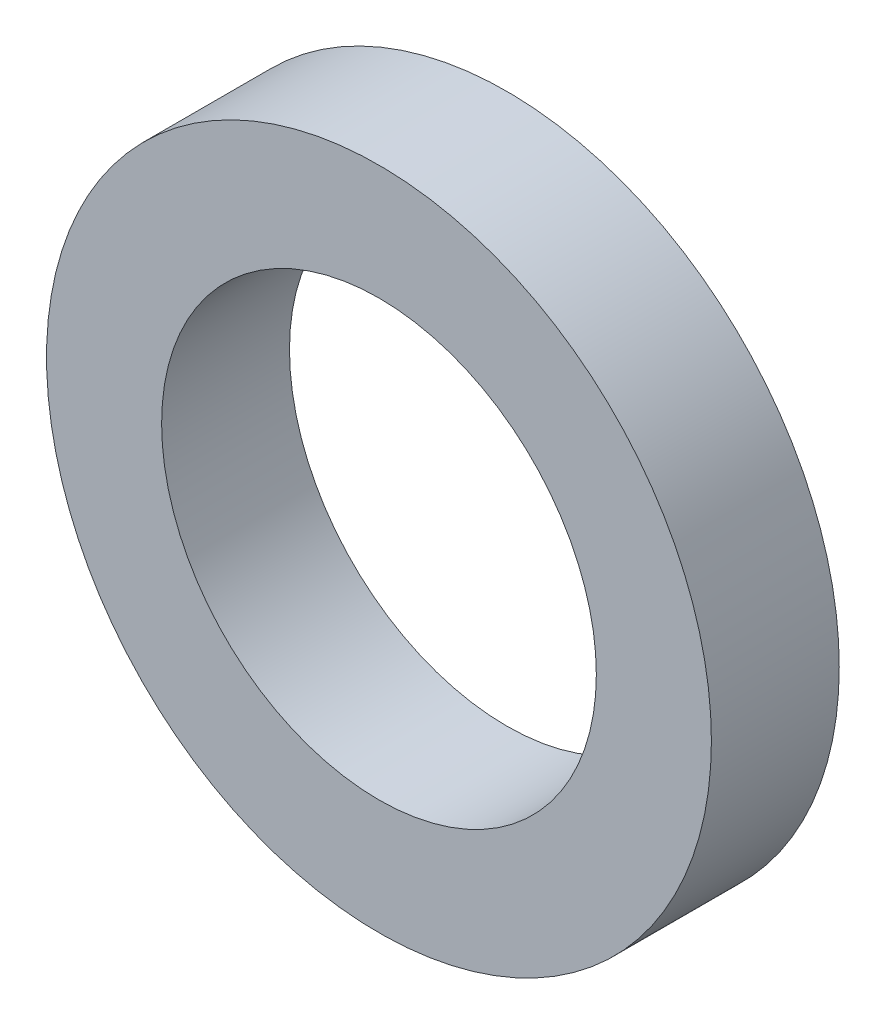
ISO-10303-21;
HEADER;
FILE_DESCRIPTION(('STEP AP214'),'2;1');
FILE_NAME('part.step','',(''),(''),'','','');
FILE_SCHEMA(('AUTOMOTIVE_DESIGN { 1 0 10303 214 1 1 1 1 }'));
ENDSEC;
DATA;
#1=APPLICATION_CONTEXT('core data for automotive mechanical design processes');
#2=APPLICATION_PROTOCOL_DEFINITION('international standard','automotive_design',2000,#1);
#3=PRODUCT_CONTEXT('',#1,'mechanical');
#4=PRODUCT('Part','Part','',(#3));
#5=PRODUCT_RELATED_PRODUCT_CATEGORY('part','',(#4));
#6=PRODUCT_DEFINITION_FORMATION('','',#4);
#7=PRODUCT_DEFINITION_CONTEXT('part definition',#1,'design');
#8=PRODUCT_DEFINITION('design','',#6,#7);
#9=PRODUCT_DEFINITION_SHAPE('','',#8);
#10=(LENGTH_UNIT() NAMED_UNIT(*) SI_UNIT(.MILLI.,.METRE.));
#11=(NAMED_UNIT(*) PLANE_ANGLE_UNIT() SI_UNIT($,.RADIAN.));
#12=(NAMED_UNIT(*) SI_UNIT($,.STERADIAN.) SOLID_ANGLE_UNIT());
#13=UNCERTAINTY_MEASURE_WITH_UNIT(LENGTH_MEASURE(1.E-05),#10,'distance_accuracy_value','');
#14=(GEOMETRIC_REPRESENTATION_CONTEXT(3) GLOBAL_UNCERTAINTY_ASSIGNED_CONTEXT((#13)) GLOBAL_UNIT_ASSIGNED_CONTEXT((#10,
#11,#12)) REPRESENTATION_CONTEXT('',''));
#15=CARTESIAN_POINT('',(0.,0.,0.));
#16=DIRECTION('',(0.,0.,1.));
#17=DIRECTION('',(1.,0.,0.));
#18=AXIS2_PLACEMENT_3D('',#15,#16,#17);
#19=CARTESIAN_POINT('',(0.,0.,5.));
#20=DIRECTION('',(0.,0.,1.));
#21=DIRECTION('',(1.,0.,0.));
#22=AXIS2_PLACEMENT_3D('',#19,#20,#21);
#23=PLANE('',#22);
#24=CARTESIAN_POINT('',(0.,0.,5.));
#25=DIRECTION('',(0.,0.,1.));
#26=DIRECTION('',(1.,0.,0.));
#27=AXIS2_PLACEMENT_3D('',#24,#25,#26);
#28=CIRCLE('',#27,13.);
#29=CARTESIAN_POINT('',(13.,0.,5.));
#30=VERTEX_POINT('',#29);
#31=EDGE_CURVE('E10',#30,#30,#28,.T.);
#32=ORIENTED_EDGE('',*,*,#31,.T.);
#33=EDGE_LOOP('',(#32));
#34=FACE_BOUND('',#33,.T.);
#35=CARTESIAN_POINT('',(0.,0.,5.));
#36=DIRECTION('',(0.,0.,1.));
#37=DIRECTION('',(1.,0.,0.));
#38=AXIS2_PLACEMENT_3D('',#35,#36,#37);
#39=CIRCLE('',#38,8.5);
#40=CARTESIAN_POINT('',(8.5,0.,5.));
#41=VERTEX_POINT('',#40);
#42=EDGE_CURVE('E48',#41,#41,#39,.T.);
#43=ORIENTED_EDGE('',*,*,#42,.F.);
#44=EDGE_LOOP('',(#43));
#45=FACE_BOUND('',#44,.T.);
#46=ADVANCED_FACE('F37',(#34,#45),#23,.T.);
#47=CARTESIAN_POINT('',(0.,0.,0.));
#48=DIRECTION('',(0.,0.,1.));
#49=DIRECTION('',(1.,0.,0.));
#50=AXIS2_PLACEMENT_3D('',#47,#48,#49);
#51=PLANE('',#50);
#52=CARTESIAN_POINT('',(0.,0.,0.));
#53=DIRECTION('',(0.,0.,1.));
#54=DIRECTION('',(1.,0.,0.));
#55=AXIS2_PLACEMENT_3D('',#52,#53,#54);
#56=CIRCLE('',#55,13.);
#57=CARTESIAN_POINT('',(13.,0.,0.));
#58=VERTEX_POINT('',#57);
#59=EDGE_CURVE('E41',#58,#58,#56,.T.);
#60=ORIENTED_EDGE('',*,*,#59,.F.);
#61=EDGE_LOOP('',(#60));
#62=FACE_BOUND('',#61,.T.);
#63=CARTESIAN_POINT('',(0.,0.,0.));
#64=DIRECTION('',(0.,0.,1.));
#65=DIRECTION('',(1.,0.,0.));
#66=AXIS2_PLACEMENT_3D('',#63,#64,#65);
#67=CIRCLE('',#66,8.5);
#68=CARTESIAN_POINT('',(8.5,0.,0.));
#69=VERTEX_POINT('',#68);
#70=EDGE_CURVE('E50',#69,#69,#67,.T.);
#71=ORIENTED_EDGE('',*,*,#70,.T.);
#72=EDGE_LOOP('',(#71));
#73=FACE_BOUND('',#72,.T.);
#74=ADVANCED_FACE('F60',(#62,#73),#51,.F.);
#75=CARTESIAN_POINT('',(0.,0.,5.));
#76=DIRECTION('',(0.,0.,-1.));
#77=DIRECTION('',(-1.,0.,0.));
#78=AXIS2_PLACEMENT_3D('',#75,#76,#77);
#79=CYLINDRICAL_SURFACE('',#78,13.);
#80=ORIENTED_EDGE('',*,*,#31,.F.);
#81=EDGE_LOOP('',(#80));
#82=FACE_BOUND('',#81,.T.);
#83=ORIENTED_EDGE('',*,*,#59,.T.);
#84=EDGE_LOOP('',(#83));
#85=FACE_BOUND('',#84,.T.);
#86=ADVANCED_FACE('F39',(#82,#85),#79,.T.);
#87=CARTESIAN_POINT('',(0.,0.,5.));
#88=DIRECTION('',(0.,0.,-1.));
#89=DIRECTION('',(-1.,0.,0.));
#90=AXIS2_PLACEMENT_3D('',#87,#88,#89);
#91=CYLINDRICAL_SURFACE('',#90,8.5);
#92=ORIENTED_EDGE('',*,*,#42,.T.);
#93=EDGE_LOOP('',(#92));
#94=FACE_BOUND('',#93,.T.);
#95=ORIENTED_EDGE('',*,*,#70,.F.);
#96=EDGE_LOOP('',(#95));
#97=FACE_BOUND('',#96,.T.);
#98=ADVANCED_FACE('F56',(#94,#97),#91,.F.);
#99=CLOSED_SHELL('',(#46,#74,#86,#98));
#100=MANIFOLD_SOLID_BREP('B2',#99);
#101=ADVANCED_BREP_SHAPE_REPRESENTATION('',(#18,#100),#14);
#102=SHAPE_DEFINITION_REPRESENTATION(#9,#101);
ENDSEC;
END-ISO-10303-21;
